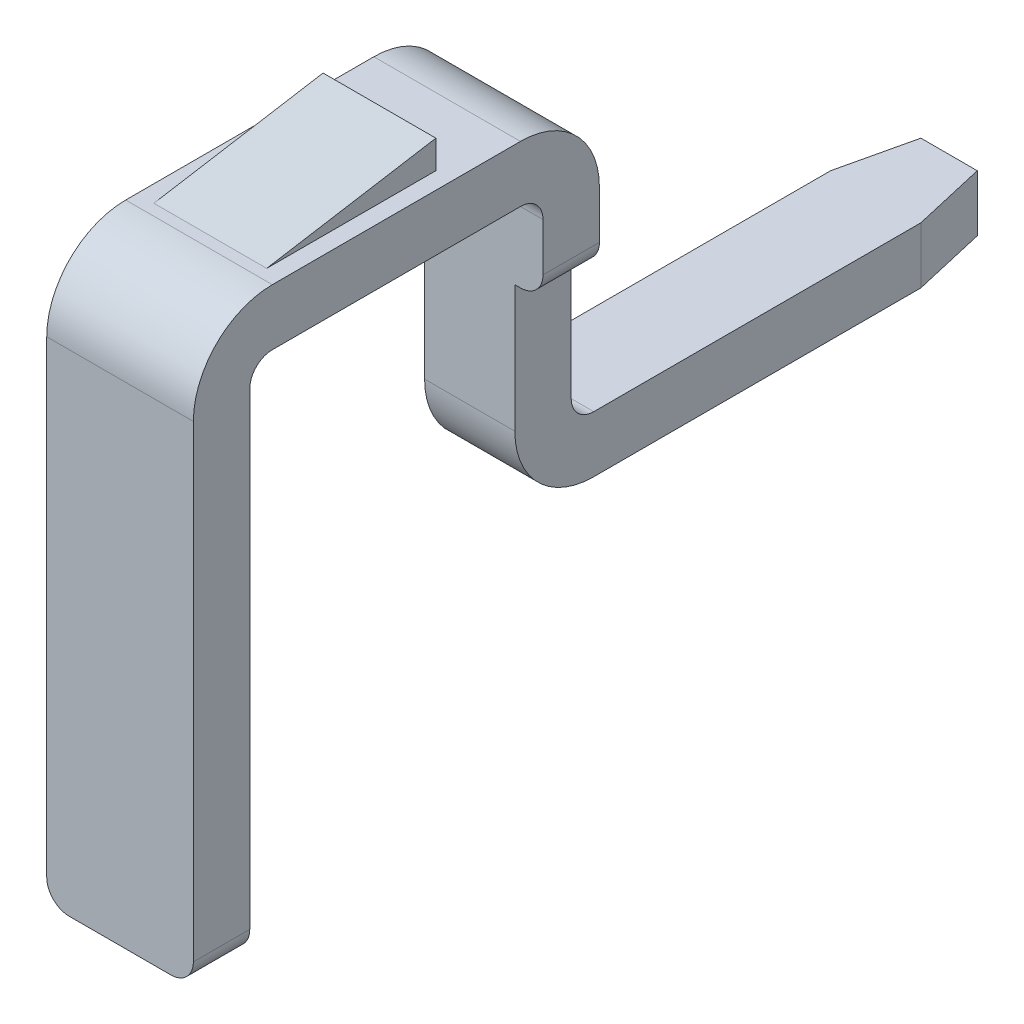
ISO-10303-21;
HEADER;
FILE_DESCRIPTION(('STEP AP214'),'2;1');
FILE_NAME('part.step','',(''),(''),'','','');
FILE_SCHEMA(('AUTOMOTIVE_DESIGN { 1 0 10303 214 1 1 1 1 }'));
ENDSEC;
DATA;
#1=APPLICATION_CONTEXT('core data for automotive mechanical design processes');
#2=APPLICATION_PROTOCOL_DEFINITION('international standard','automotive_design',2000,#1);
#3=PRODUCT_CONTEXT('',#1,'mechanical');
#4=PRODUCT('Part','Part','',(#3));
#5=PRODUCT_RELATED_PRODUCT_CATEGORY('part','',(#4));
#6=PRODUCT_DEFINITION_FORMATION('','',#4);
#7=PRODUCT_DEFINITION_CONTEXT('part definition',#1,'design');
#8=PRODUCT_DEFINITION('design','',#6,#7);
#9=PRODUCT_DEFINITION_SHAPE('','',#8);
#10=(LENGTH_UNIT() NAMED_UNIT(*) SI_UNIT(.MILLI.,.METRE.));
#11=(NAMED_UNIT(*) PLANE_ANGLE_UNIT() SI_UNIT($,.RADIAN.));
#12=(NAMED_UNIT(*) SI_UNIT($,.STERADIAN.) SOLID_ANGLE_UNIT());
#13=UNCERTAINTY_MEASURE_WITH_UNIT(LENGTH_MEASURE(1.E-05),#10,'distance_accuracy_value','');
#14=(GEOMETRIC_REPRESENTATION_CONTEXT(3) GLOBAL_UNCERTAINTY_ASSIGNED_CONTEXT((#13)) GLOBAL_UNIT_ASSIGNED_CONTEXT((#10,
#11,#12)) REPRESENTATION_CONTEXT('',''));
#15=CARTESIAN_POINT('',(0.,0.,0.));
#16=DIRECTION('',(0.,0.,1.));
#17=DIRECTION('',(1.,0.,0.));
#18=AXIS2_PLACEMENT_3D('',#15,#16,#17);
#19=CARTESIAN_POINT('',(-0.45,-1.95,3.8));
#20=DIRECTION('',(0.,0.,1.));
#21=DIRECTION('',(1.,0.,0.));
#22=AXIS2_PLACEMENT_3D('',#19,#20,#21);
#23=CYLINDRICAL_SURFACE('',#22,0.2);
#24=CARTESIAN_POINT('',(-0.45,-1.95,3.8));
#25=DIRECTION('',(0.,0.,1.));
#26=DIRECTION('',(1.,0.,0.));
#27=AXIS2_PLACEMENT_3D('',#24,#25,#26);
#28=CIRCLE('',#27,0.2);
#29=CARTESIAN_POINT('',(-0.65,-1.95,3.8));
#30=VERTEX_POINT('',#29);
#31=CARTESIAN_POINT('',(-0.45,-2.15,3.8));
#32=VERTEX_POINT('',#31);
#33=EDGE_CURVE('E358',#30,#32,#28,.T.);
#34=ORIENTED_EDGE('',*,*,#33,.F.);
#35=DIRECTION('',(0.,0.,1.));
#36=VECTOR('',#35,1.);
#37=CARTESIAN_POINT('',(-0.65,-1.95,3.8));
#38=LINE('',#37,#36);
#39=CARTESIAN_POINT('',(-0.65,-1.95,3.3));
#40=VERTEX_POINT('',#39);
#41=EDGE_CURVE('E321',#40,#30,#38,.T.);
#42=ORIENTED_EDGE('',*,*,#41,.F.);
#43=CARTESIAN_POINT('',(-0.45,-1.95,3.3));
#44=DIRECTION('',(0.,0.,-1.));
#45=DIRECTION('',(-1.,0.,0.));
#46=AXIS2_PLACEMENT_3D('',#43,#44,#45);
#47=CIRCLE('',#46,0.2);
#48=CARTESIAN_POINT('',(-0.45,-2.15,3.3));
#49=VERTEX_POINT('',#48);
#50=EDGE_CURVE('E541',#49,#40,#47,.T.);
#51=ORIENTED_EDGE('',*,*,#50,.F.);
#52=DIRECTION('',(0.,0.,-1.));
#53=VECTOR('',#52,1.);
#54=CARTESIAN_POINT('',(-0.45,-2.15,3.3));
#55=LINE('',#54,#53);
#56=EDGE_CURVE('E388',#32,#49,#55,.T.);
#57=ORIENTED_EDGE('',*,*,#56,.F.);
#58=EDGE_LOOP('',(#34,#42,#51,#57));
#59=FACE_BOUND('',#58,.T.);
#60=ADVANCED_FACE('F16',(#59),#23,.T.);
#61=CARTESIAN_POINT('',(0.45,-1.95,0.7));
#62=DIRECTION('',(0.,0.,1.));
#63=DIRECTION('',(1.,0.,0.));
#64=AXIS2_PLACEMENT_3D('',#61,#62,#63);
#65=CYLINDRICAL_SURFACE('',#64,0.2);
#66=CARTESIAN_POINT('',(0.45,-1.95,3.8));
#67=DIRECTION('',(0.,0.,1.));
#68=DIRECTION('',(1.,0.,0.));
#69=AXIS2_PLACEMENT_3D('',#66,#67,#68);
#70=CIRCLE('',#69,0.2);
#71=CARTESIAN_POINT('',(0.45,-2.15,3.8));
#72=VERTEX_POINT('',#71);
#73=CARTESIAN_POINT('',(0.65,-1.95,3.8));
#74=VERTEX_POINT('',#73);
#75=EDGE_CURVE('E357',#72,#74,#70,.T.);
#76=ORIENTED_EDGE('',*,*,#75,.F.);
#77=DIRECTION('',(0.,0.,1.));
#78=VECTOR('',#77,1.);
#79=CARTESIAN_POINT('',(0.45,-2.15,3.8));
#80=LINE('',#79,#78);
#81=CARTESIAN_POINT('',(0.45,-2.15,3.3));
#82=VERTEX_POINT('',#81);
#83=EDGE_CURVE('E384',#82,#72,#80,.T.);
#84=ORIENTED_EDGE('',*,*,#83,.F.);
#85=CARTESIAN_POINT('',(0.45,-1.95,3.3));
#86=DIRECTION('',(0.,0.,-1.));
#87=DIRECTION('',(-1.,0.,0.));
#88=AXIS2_PLACEMENT_3D('',#85,#86,#87);
#89=CIRCLE('',#88,0.2);
#90=CARTESIAN_POINT('',(0.65,-1.95,3.3));
#91=VERTEX_POINT('',#90);
#92=EDGE_CURVE('E407',#91,#82,#89,.T.);
#93=ORIENTED_EDGE('',*,*,#92,.F.);
#94=DIRECTION('',(0.,0.,-1.));
#95=VECTOR('',#94,1.);
#96=CARTESIAN_POINT('',(0.65,-1.95,3.3));
#97=LINE('',#96,#95);
#98=EDGE_CURVE('E406',#74,#91,#97,.T.);
#99=ORIENTED_EDGE('',*,*,#98,.F.);
#100=EDGE_LOOP('',(#76,#84,#93,#99));
#101=FACE_BOUND('',#100,.T.);
#102=ADVANCED_FACE('F621',(#101),#65,.T.);
#103=CARTESIAN_POINT('',(-0.5,3.15,1.5));
#104=DIRECTION('',(0.,-0.986393923832144,-0.164398987305357));
#105=DIRECTION('',(0.,0.164398987305357,-0.986393923832144));
#106=AXIS2_PLACEMENT_3D('',#103,#104,#105);
#107=PLANE('',#106);
#108=DIRECTION('',(0.,0.164398987305357,-0.986393923832144));
#109=VECTOR('',#108,1.);
#110=CARTESIAN_POINT('',(0.5,3.15,1.5));
#111=LINE('',#110,#109);
#112=CARTESIAN_POINT('',(0.5,2.9,3.));
#113=VERTEX_POINT('',#112);
#114=CARTESIAN_POINT('',(0.5,3.15,1.5));
#115=VERTEX_POINT('',#114);
#116=EDGE_CURVE('E416',#113,#115,#111,.T.);
#117=ORIENTED_EDGE('',*,*,#116,.T.);
#118=DIRECTION('',(-1.,0.,0.));
#119=VECTOR('',#118,1.);
#120=CARTESIAN_POINT('',(0.5,3.15,1.5));
#121=LINE('',#120,#119);
#122=CARTESIAN_POINT('',(-0.5,3.15,1.5));
#123=VERTEX_POINT('',#122);
#124=EDGE_CURVE('E27',#115,#123,#121,.T.);
#125=ORIENTED_EDGE('',*,*,#124,.T.);
#126=DIRECTION('',(0.,0.164398987305357,-0.986393923832144));
#127=VECTOR('',#126,1.);
#128=CARTESIAN_POINT('',(-0.5,3.15,1.5));
#129=LINE('',#128,#127);
#130=CARTESIAN_POINT('',(-0.5,2.9,3.));
#131=VERTEX_POINT('',#130);
#132=EDGE_CURVE('E11',#131,#123,#129,.T.);
#133=ORIENTED_EDGE('',*,*,#132,.F.);
#134=DIRECTION('',(1.,0.,0.));
#135=VECTOR('',#134,1.);
#136=CARTESIAN_POINT('',(-0.5,2.9,3.));
#137=LINE('',#136,#135);
#138=EDGE_CURVE('E428',#131,#113,#137,.T.);
#139=ORIENTED_EDGE('',*,*,#138,.T.);
#140=EDGE_LOOP('',(#117,#125,#133,#139));
#141=FACE_BOUND('',#140,.T.);
#142=ADVANCED_FACE('F627',(#141),#107,.F.);
#143=CARTESIAN_POINT('',(-0.5,3.15,1.5));
#144=DIRECTION('',(1.,0.,0.));
#145=DIRECTION('',(0.,0.,-1.));
#146=AXIS2_PLACEMENT_3D('',#143,#144,#145);
#147=PLANE('',#146);
#148=DIRECTION('',(0.,0.,1.));
#149=VECTOR('',#148,1.);
#150=CARTESIAN_POINT('',(-0.5,2.9,1.5));
#151=LINE('',#150,#149);
#152=CARTESIAN_POINT('',(-0.5,2.9,1.5));
#153=VERTEX_POINT('',#152);
#154=EDGE_CURVE('E424',#153,#131,#151,.T.);
#155=ORIENTED_EDGE('',*,*,#154,.T.);
#156=ORIENTED_EDGE('',*,*,#132,.T.);
#157=DIRECTION('',(0.,-1.,0.));
#158=VECTOR('',#157,1.);
#159=CARTESIAN_POINT('',(-0.5,3.15,1.5));
#160=LINE('',#159,#158);
#161=EDGE_CURVE('E387',#123,#153,#160,.T.);
#162=ORIENTED_EDGE('',*,*,#161,.T.);
#163=EDGE_LOOP('',(#155,#156,#162));
#164=FACE_BOUND('',#163,.T.);
#165=ADVANCED_FACE('F632',(#164),#147,.F.);
#166=CARTESIAN_POINT('',(0.5,3.15,1.5));
#167=DIRECTION('',(0.,0.,1.));
#168=DIRECTION('',(1.,0.,0.));
#169=AXIS2_PLACEMENT_3D('',#166,#167,#168);
#170=PLANE('',#169);
#171=DIRECTION('',(-1.,0.,0.));
#172=VECTOR('',#171,1.);
#173=CARTESIAN_POINT('',(0.5,2.9,1.5));
#174=LINE('',#173,#172);
#175=CARTESIAN_POINT('',(0.5,2.9,1.5));
#176=VERTEX_POINT('',#175);
#177=EDGE_CURVE('E520',#176,#153,#174,.T.);
#178=ORIENTED_EDGE('',*,*,#177,.T.);
#179=ORIENTED_EDGE('',*,*,#161,.F.);
#180=ORIENTED_EDGE('',*,*,#124,.F.);
#181=DIRECTION('',(0.,-1.,0.));
#182=VECTOR('',#181,1.);
#183=CARTESIAN_POINT('',(0.5,3.15,1.5));
#184=LINE('',#183,#182);
#185=EDGE_CURVE('E487',#115,#176,#184,.T.);
#186=ORIENTED_EDGE('',*,*,#185,.T.);
#187=EDGE_LOOP('',(#178,#179,#180,#186));
#188=FACE_BOUND('',#187,.T.);
#189=ADVANCED_FACE('F663',(#188),#170,.F.);
#190=CARTESIAN_POINT('',(0.4,-0.25,-2.9));
#191=DIRECTION('',(-0.97439119569462,0.,0.224859506698758));
#192=DIRECTION('',(0.,1.,0.));
#193=AXIS2_PLACEMENT_3D('',#190,#191,#192);
#194=PLANE('',#193);
#195=DIRECTION('',(0.224859506698758,0.,0.97439119569462));
#196=VECTOR('',#195,1.);
#197=CARTESIAN_POINT('',(0.4,-0.25,-2.9));
#198=LINE('',#197,#196);
#199=CARTESIAN_POINT('',(0.25,-0.25,-3.55));
#200=VERTEX_POINT('',#199);
#201=CARTESIAN_POINT('',(0.4,-0.25,-2.9));
#202=VERTEX_POINT('',#201);
#203=EDGE_CURVE('E256',#200,#202,#198,.T.);
#204=ORIENTED_EDGE('',*,*,#203,.F.);
#205=DIRECTION('',(0.,-1.,0.));
#206=VECTOR('',#205,1.);
#207=CARTESIAN_POINT('',(0.25,0.,-3.55));
#208=LINE('',#207,#206);
#209=CARTESIAN_POINT('',(0.25,0.25,-3.55));
#210=VERTEX_POINT('',#209);
#211=EDGE_CURVE('E249',#210,#200,#208,.T.);
#212=ORIENTED_EDGE('',*,*,#211,.F.);
#213=DIRECTION('',(-0.224859506698758,0.,-0.97439119569462));
#214=VECTOR('',#213,1.);
#215=CARTESIAN_POINT('',(0.4,0.25,-2.9));
#216=LINE('',#215,#214);
#217=CARTESIAN_POINT('',(0.4,0.25,-2.9));
#218=VERTEX_POINT('',#217);
#219=EDGE_CURVE('E253',#218,#210,#216,.T.);
#220=ORIENTED_EDGE('',*,*,#219,.F.);
#221=DIRECTION('',(0.,1.,0.));
#222=VECTOR('',#221,1.);
#223=CARTESIAN_POINT('',(0.4,-0.25,-2.9));
#224=LINE('',#223,#222);
#225=EDGE_CURVE('E20',#202,#218,#224,.T.);
#226=ORIENTED_EDGE('',*,*,#225,.F.);
#227=EDGE_LOOP('',(#204,#212,#220,#226));
#228=FACE_BOUND('',#227,.T.);
#229=ADVANCED_FACE('F251',(#228),#194,.F.);
#230=CARTESIAN_POINT('',(-0.4,0.25,-2.9));
#231=DIRECTION('',(0.97439119569462,0.,0.224859506698758));
#232=DIRECTION('',(0.,-1.,0.));
#233=AXIS2_PLACEMENT_3D('',#230,#231,#232);
#234=PLANE('',#233);
#235=DIRECTION('',(-0.224859506698758,0.,0.97439119569462));
#236=VECTOR('',#235,1.);
#237=CARTESIAN_POINT('',(-0.4,0.25,-2.9));
#238=LINE('',#237,#236);
#239=CARTESIAN_POINT('',(-0.25,0.25,-3.55));
#240=VERTEX_POINT('',#239);
#241=CARTESIAN_POINT('',(-0.4,0.25,-2.9));
#242=VERTEX_POINT('',#241);
#243=EDGE_CURVE('E278',#240,#242,#238,.T.);
#244=ORIENTED_EDGE('',*,*,#243,.F.);
#245=DIRECTION('',(0.,1.,0.));
#246=VECTOR('',#245,1.);
#247=CARTESIAN_POINT('',(-0.25,0.,-3.55));
#248=LINE('',#247,#246);
#249=CARTESIAN_POINT('',(-0.25,-0.25,-3.55));
#250=VERTEX_POINT('',#249);
#251=EDGE_CURVE('E263',#250,#240,#248,.T.);
#252=ORIENTED_EDGE('',*,*,#251,.F.);
#253=DIRECTION('',(0.224859506698758,0.,-0.97439119569462));
#254=VECTOR('',#253,1.);
#255=CARTESIAN_POINT('',(-0.4,-0.25,-2.9));
#256=LINE('',#255,#254);
#257=CARTESIAN_POINT('',(-0.4,-0.25,-2.9));
#258=VERTEX_POINT('',#257);
#259=EDGE_CURVE('E273',#258,#250,#256,.T.);
#260=ORIENTED_EDGE('',*,*,#259,.F.);
#261=DIRECTION('',(0.,-1.,0.));
#262=VECTOR('',#261,1.);
#263=CARTESIAN_POINT('',(-0.4,0.25,-2.9));
#264=LINE('',#263,#262);
#265=EDGE_CURVE('E441',#242,#258,#264,.T.);
#266=ORIENTED_EDGE('',*,*,#265,.F.);
#267=EDGE_LOOP('',(#244,#252,#260,#266));
#268=FACE_BOUND('',#267,.T.);
#269=ADVANCED_FACE('F658',(#268),#234,.F.);
#270=CARTESIAN_POINT('',(0.4,2.2,0.9));
#271=DIRECTION('',(-1.,0.,0.));
#272=DIRECTION('',(0.,0.,1.));
#273=AXIS2_PLACEMENT_3D('',#270,#271,#272);
#274=CYLINDRICAL_SURFACE('',#273,0.7);
#275=CARTESIAN_POINT('',(0.65,2.2,0.9));
#276=DIRECTION('',(1.,0.,0.));
#277=DIRECTION('',(0.,0.,1.));
#278=AXIS2_PLACEMENT_3D('',#275,#276,#277);
#279=CIRCLE('',#278,0.7);
#280=CARTESIAN_POINT('',(0.65,2.2,0.2));
#281=VERTEX_POINT('',#280);
#282=CARTESIAN_POINT('',(0.65,2.9,0.9));
#283=VERTEX_POINT('',#282);
#284=EDGE_CURVE('E317',#281,#283,#279,.T.);
#285=ORIENTED_EDGE('',*,*,#284,.F.);
#286=DIRECTION('',(1.,0.,0.));
#287=VECTOR('',#286,1.);
#288=CARTESIAN_POINT('',(0.4,2.2,0.2));
#289=LINE('',#288,#287);
#290=CARTESIAN_POINT('',(-0.65,2.2,0.2));
#291=VERTEX_POINT('',#290);
#292=EDGE_CURVE('E367',#291,#281,#289,.T.);
#293=ORIENTED_EDGE('',*,*,#292,.F.);
#294=CARTESIAN_POINT('',(-0.65,2.2,0.9));
#295=DIRECTION('',(-1.,0.,0.));
#296=DIRECTION('',(0.,0.,-1.));
#297=AXIS2_PLACEMENT_3D('',#294,#295,#296);
#298=CIRCLE('',#297,0.7);
#299=CARTESIAN_POINT('',(-0.65,2.9,0.9));
#300=VERTEX_POINT('',#299);
#301=EDGE_CURVE('E293',#300,#291,#298,.T.);
#302=ORIENTED_EDGE('',*,*,#301,.F.);
#303=DIRECTION('',(-1.,0.,0.));
#304=VECTOR('',#303,1.);
#305=CARTESIAN_POINT('',(0.4,2.9,0.9));
#306=LINE('',#305,#304);
#307=EDGE_CURVE('E492',#283,#300,#306,.T.);
#308=ORIENTED_EDGE('',*,*,#307,.F.);
#309=EDGE_LOOP('',(#285,#293,#302,#308));
#310=FACE_BOUND('',#309,.T.);
#311=ADVANCED_FACE('F469',(#310),#274,.T.);
#312=CARTESIAN_POINT('',(0.,2.2,3.1));
#313=DIRECTION('',(1.,0.,0.));
#314=DIRECTION('',(0.,0.,-1.));
#315=AXIS2_PLACEMENT_3D('',#312,#313,#314);
#316=CYLINDRICAL_SURFACE('',#315,0.7);
#317=CARTESIAN_POINT('',(0.65,2.2,3.1));
#318=DIRECTION('',(1.,0.,0.));
#319=DIRECTION('',(0.,0.,1.));
#320=AXIS2_PLACEMENT_3D('',#317,#318,#319);
#321=CIRCLE('',#320,0.7);
#322=CARTESIAN_POINT('',(0.65,2.9,3.1));
#323=VERTEX_POINT('',#322);
#324=CARTESIAN_POINT('',(0.65,2.2,3.8));
#325=VERTEX_POINT('',#324);
#326=EDGE_CURVE('E313',#323,#325,#321,.T.);
#327=ORIENTED_EDGE('',*,*,#326,.F.);
#328=DIRECTION('',(1.,0.,0.));
#329=VECTOR('',#328,1.);
#330=CARTESIAN_POINT('',(0.6,2.9,3.1));
#331=LINE('',#330,#329);
#332=CARTESIAN_POINT('',(-0.65,2.9,3.1));
#333=VERTEX_POINT('',#332);
#334=EDGE_CURVE('E524',#333,#323,#331,.T.);
#335=ORIENTED_EDGE('',*,*,#334,.F.);
#336=CARTESIAN_POINT('',(-0.65,2.2,3.1));
#337=DIRECTION('',(-1.,0.,0.));
#338=DIRECTION('',(0.,0.,-1.));
#339=AXIS2_PLACEMENT_3D('',#336,#337,#338);
#340=CIRCLE('',#339,0.7);
#341=CARTESIAN_POINT('',(-0.65,2.2,3.8));
#342=VERTEX_POINT('',#341);
#343=EDGE_CURVE('E318',#342,#333,#340,.T.);
#344=ORIENTED_EDGE('',*,*,#343,.F.);
#345=DIRECTION('',(-1.,0.,0.));
#346=VECTOR('',#345,1.);
#347=CARTESIAN_POINT('',(-0.6,2.2,3.8));
#348=LINE('',#347,#346);
#349=EDGE_CURVE('E438',#325,#342,#348,.T.);
#350=ORIENTED_EDGE('',*,*,#349,.F.);
#351=EDGE_LOOP('',(#327,#335,#344,#350));
#352=FACE_BOUND('',#351,.T.);
#353=ADVANCED_FACE('F657',(#352),#316,.T.);
#354=CARTESIAN_POINT('',(0.,0.45,0.));
#355=DIRECTION('',(-1.,0.,0.));
#356=DIRECTION('',(0.,0.,1.));
#357=AXIS2_PLACEMENT_3D('',#354,#355,#356);
#358=CYLINDRICAL_SURFACE('',#357,0.7);
#359=CARTESIAN_POINT('',(-0.4,0.45,0.));
#360=DIRECTION('',(-1.,0.,0.));
#361=DIRECTION('',(0.,0.,-1.));
#362=AXIS2_PLACEMENT_3D('',#359,#360,#361);
#363=CIRCLE('',#362,0.7);
#364=CARTESIAN_POINT('',(-0.4,-0.25,0.));
#365=VERTEX_POINT('',#364);
#366=CARTESIAN_POINT('',(-0.4,0.45,0.7));
#367=VERTEX_POINT('',#366);
#368=EDGE_CURVE('E307',#365,#367,#363,.T.);
#369=ORIENTED_EDGE('',*,*,#368,.F.);
#370=DIRECTION('',(-1.,0.,0.));
#371=VECTOR('',#370,1.);
#372=CARTESIAN_POINT('',(-0.4,-0.25,0.));
#373=LINE('',#372,#371);
#374=CARTESIAN_POINT('',(0.4,-0.25,0.));
#375=VERTEX_POINT('',#374);
#376=EDGE_CURVE('E322',#375,#365,#373,.T.);
#377=ORIENTED_EDGE('',*,*,#376,.F.);
#378=CARTESIAN_POINT('',(0.4,0.45,0.));
#379=DIRECTION('',(1.,0.,0.));
#380=DIRECTION('',(0.,0.,1.));
#381=AXIS2_PLACEMENT_3D('',#378,#379,#380);
#382=CIRCLE('',#381,0.7);
#383=CARTESIAN_POINT('',(0.4,0.45,0.7));
#384=VERTEX_POINT('',#383);
#385=EDGE_CURVE('E478',#384,#375,#382,.T.);
#386=ORIENTED_EDGE('',*,*,#385,.F.);
#387=DIRECTION('',(1.,0.,0.));
#388=VECTOR('',#387,1.);
#389=CARTESIAN_POINT('',(0.4,0.45,0.7));
#390=LINE('',#389,#388);
#391=EDGE_CURVE('E305',#367,#384,#390,.T.);
#392=ORIENTED_EDGE('',*,*,#391,.F.);
#393=EDGE_LOOP('',(#369,#377,#386,#392));
#394=FACE_BOUND('',#393,.T.);
#395=ADVANCED_FACE('F648',(#394),#358,.T.);
#396=CARTESIAN_POINT('',(0.,2.2,0.9));
#397=DIRECTION('',(1.,0.,0.));
#398=DIRECTION('',(0.,1.,0.));
#399=AXIS2_PLACEMENT_3D('',#396,#397,#398);
#400=CYLINDRICAL_SURFACE('',#399,0.2);
#401=CARTESIAN_POINT('',(0.65,2.2,0.9));
#402=DIRECTION('',(-1.,0.,0.));
#403=DIRECTION('',(0.,0.,1.));
#404=AXIS2_PLACEMENT_3D('',#401,#402,#403);
#405=CIRCLE('',#404,0.2);
#406=CARTESIAN_POINT('',(0.65,2.4,0.9));
#407=VERTEX_POINT('',#406);
#408=CARTESIAN_POINT('',(0.65,2.2,0.7));
#409=VERTEX_POINT('',#408);
#410=EDGE_CURVE('E546',#407,#409,#405,.T.);
#411=ORIENTED_EDGE('',*,*,#410,.F.);
#412=DIRECTION('',(1.,0.,0.));
#413=VECTOR('',#412,1.);
#414=CARTESIAN_POINT('',(0.6,2.4,0.9));
#415=LINE('',#414,#413);
#416=CARTESIAN_POINT('',(-0.65,2.4,0.9));
#417=VERTEX_POINT('',#416);
#418=EDGE_CURVE('E347',#417,#407,#415,.T.);
#419=ORIENTED_EDGE('',*,*,#418,.F.);
#420=CARTESIAN_POINT('',(-0.65,2.2,0.9));
#421=DIRECTION('',(1.,0.,0.));
#422=DIRECTION('',(0.,0.,-1.));
#423=AXIS2_PLACEMENT_3D('',#420,#421,#422);
#424=CIRCLE('',#423,0.2);
#425=CARTESIAN_POINT('',(-0.65,2.2,0.7));
#426=VERTEX_POINT('',#425);
#427=EDGE_CURVE('E378',#426,#417,#424,.T.);
#428=ORIENTED_EDGE('',*,*,#427,.F.);
#429=DIRECTION('',(-1.,0.,0.));
#430=VECTOR('',#429,1.);
#431=CARTESIAN_POINT('',(-0.6,2.2,0.7));
#432=LINE('',#431,#430);
#433=EDGE_CURVE('E337',#409,#426,#432,.T.);
#434=ORIENTED_EDGE('',*,*,#433,.F.);
#435=EDGE_LOOP('',(#411,#419,#428,#434));
#436=FACE_BOUND('',#435,.T.);
#437=ADVANCED_FACE('F565',(#436),#400,.F.);
#438=CARTESIAN_POINT('',(0.,2.2,3.1));
#439=DIRECTION('',(1.,0.,0.));
#440=DIRECTION('',(0.,1.,0.));
#441=AXIS2_PLACEMENT_3D('',#438,#439,#440);
#442=CYLINDRICAL_SURFACE('',#441,0.2);
#443=CARTESIAN_POINT('',(0.65,2.2,3.1));
#444=DIRECTION('',(-1.,0.,0.));
#445=DIRECTION('',(0.,0.,1.));
#446=AXIS2_PLACEMENT_3D('',#443,#444,#445);
#447=CIRCLE('',#446,0.2);
#448=CARTESIAN_POINT('',(0.65,2.2,3.3));
#449=VERTEX_POINT('',#448);
#450=CARTESIAN_POINT('',(0.65,2.4,3.1));
#451=VERTEX_POINT('',#450);
#452=EDGE_CURVE('E405',#449,#451,#447,.T.);
#453=ORIENTED_EDGE('',*,*,#452,.F.);
#454=DIRECTION('',(1.,0.,0.));
#455=VECTOR('',#454,1.);
#456=CARTESIAN_POINT('',(0.6,2.2,3.3));
#457=LINE('',#456,#455);
#458=CARTESIAN_POINT('',(-0.65,2.2,3.3));
#459=VERTEX_POINT('',#458);
#460=EDGE_CURVE('E411',#459,#449,#457,.T.);
#461=ORIENTED_EDGE('',*,*,#460,.F.);
#462=CARTESIAN_POINT('',(-0.65,2.2,3.1));
#463=DIRECTION('',(1.,0.,0.));
#464=DIRECTION('',(0.,0.,-1.));
#465=AXIS2_PLACEMENT_3D('',#462,#463,#464);
#466=CIRCLE('',#465,0.2);
#467=CARTESIAN_POINT('',(-0.65,2.4,3.1));
#468=VERTEX_POINT('',#467);
#469=EDGE_CURVE('E382',#468,#459,#466,.T.);
#470=ORIENTED_EDGE('',*,*,#469,.F.);
#471=DIRECTION('',(-1.,0.,0.));
#472=VECTOR('',#471,1.);
#473=CARTESIAN_POINT('',(-0.6,2.4,3.1));
#474=LINE('',#473,#472);
#475=EDGE_CURVE('E501',#451,#468,#474,.T.);
#476=ORIENTED_EDGE('',*,*,#475,.F.);
#477=EDGE_LOOP('',(#453,#461,#470,#476));
#478=FACE_BOUND('',#477,.T.);
#479=ADVANCED_FACE('F616',(#478),#442,.F.);
#480=CARTESIAN_POINT('',(0.45,1.775,0.2));
#481=DIRECTION('',(0.,0.,1.));
#482=DIRECTION('',(1.,0.,0.));
#483=AXIS2_PLACEMENT_3D('',#480,#481,#482);
#484=CYLINDRICAL_SURFACE('',#483,0.2);
#485=CARTESIAN_POINT('',(0.45,1.775,0.2));
#486=DIRECTION('',(0.,0.,-1.));
#487=DIRECTION('',(1.,0.,0.));
#488=AXIS2_PLACEMENT_3D('',#485,#486,#487);
#489=CIRCLE('',#488,0.2);
#490=CARTESIAN_POINT('',(0.65,1.775,0.2));
#491=VERTEX_POINT('',#490);
#492=CARTESIAN_POINT('',(0.449997009541553,1.575,0.2));
#493=VERTEX_POINT('',#492);
#494=EDGE_CURVE('E366',#491,#493,#489,.T.);
#495=ORIENTED_EDGE('',*,*,#494,.F.);
#496=DIRECTION('',(0.,0.,-1.));
#497=VECTOR('',#496,1.);
#498=CARTESIAN_POINT('',(0.65,1.775,0.7));
#499=LINE('',#498,#497);
#500=CARTESIAN_POINT('',(0.65,1.775,0.7));
#501=VERTEX_POINT('',#500);
#502=EDGE_CURVE('E361',#501,#491,#499,.T.);
#503=ORIENTED_EDGE('',*,*,#502,.F.);
#504=CARTESIAN_POINT('',(0.45,1.775,0.7));
#505=DIRECTION('',(0.,0.,1.));
#506=DIRECTION('',(1.,0.,0.));
#507=AXIS2_PLACEMENT_3D('',#504,#505,#506);
#508=CIRCLE('',#507,0.2);
#509=CARTESIAN_POINT('',(0.449997009541553,1.575,0.7));
#510=VERTEX_POINT('',#509);
#511=EDGE_CURVE('E338',#510,#501,#508,.T.);
#512=ORIENTED_EDGE('',*,*,#511,.F.);
#513=DIRECTION('',(0.,0.,-1.));
#514=VECTOR('',#513,1.);
#515=CARTESIAN_POINT('',(0.45,1.575,0.45));
#516=LINE('',#515,#514);
#517=EDGE_CURVE('E414',#510,#493,#516,.T.);
#518=ORIENTED_EDGE('',*,*,#517,.T.);
#519=EDGE_LOOP('',(#495,#503,#512,#518));
#520=FACE_BOUND('',#519,.T.);
#521=ADVANCED_FACE('F574',(#520),#484,.T.);
#522=CARTESIAN_POINT('',(-0.45,1.775,0.7));
#523=DIRECTION('',(0.,0.,-1.));
#524=DIRECTION('',(-1.,0.,0.));
#525=AXIS2_PLACEMENT_3D('',#522,#523,#524);
#526=CYLINDRICAL_SURFACE('',#525,0.2);
#527=CARTESIAN_POINT('',(-0.45,1.775,0.2));
#528=DIRECTION('',(0.,0.,-1.));
#529=DIRECTION('',(1.,0.,0.));
#530=AXIS2_PLACEMENT_3D('',#527,#528,#529);
#531=CIRCLE('',#530,0.2);
#532=CARTESIAN_POINT('',(-0.449997009541553,1.575,0.2));
#533=VERTEX_POINT('',#532);
#534=CARTESIAN_POINT('',(-0.65,1.775,0.2));
#535=VERTEX_POINT('',#534);
#536=EDGE_CURVE('E348',#533,#535,#531,.T.);
#537=ORIENTED_EDGE('',*,*,#536,.F.);
#538=DIRECTION('',(0.,0.,1.));
#539=VECTOR('',#538,1.);
#540=CARTESIAN_POINT('',(-0.45,1.575,0.45));
#541=LINE('',#540,#539);
#542=CARTESIAN_POINT('',(-0.449997009541553,1.575,0.7));
#543=VERTEX_POINT('',#542);
#544=EDGE_CURVE('E427',#533,#543,#541,.T.);
#545=ORIENTED_EDGE('',*,*,#544,.T.);
#546=CARTESIAN_POINT('',(-0.45,1.775,0.7));
#547=DIRECTION('',(0.,0.,1.));
#548=DIRECTION('',(1.,0.,0.));
#549=AXIS2_PLACEMENT_3D('',#546,#547,#548);
#550=CIRCLE('',#549,0.2);
#551=CARTESIAN_POINT('',(-0.65,1.775,0.7));
#552=VERTEX_POINT('',#551);
#553=EDGE_CURVE('E279',#552,#543,#550,.T.);
#554=ORIENTED_EDGE('',*,*,#553,.F.);
#555=DIRECTION('',(0.,0.,1.));
#556=VECTOR('',#555,1.);
#557=CARTESIAN_POINT('',(-0.65,1.775,0.7));
#558=LINE('',#557,#556);
#559=EDGE_CURVE('E383',#535,#552,#558,.T.);
#560=ORIENTED_EDGE('',*,*,#559,.F.);
#561=EDGE_LOOP('',(#537,#545,#554,#560));
#562=FACE_BOUND('',#561,.T.);
#563=ADVANCED_FACE('F604',(#562),#526,.T.);
#564=CARTESIAN_POINT('',(0.4,0.45,0.));
#565=DIRECTION('',(1.,0.,0.));
#566=DIRECTION('',(0.,0.,-1.));
#567=AXIS2_PLACEMENT_3D('',#564,#565,#566);
#568=CYLINDRICAL_SURFACE('',#567,0.2);
#569=CARTESIAN_POINT('',(0.4,0.45,0.));
#570=DIRECTION('',(-1.,0.,0.));
#571=DIRECTION('',(0.,0.,1.));
#572=AXIS2_PLACEMENT_3D('',#569,#570,#571);
#573=CIRCLE('',#572,0.2);
#574=CARTESIAN_POINT('',(0.4,0.25,0.));
#575=VERTEX_POINT('',#574);
#576=CARTESIAN_POINT('',(0.4,0.45,0.2));
#577=VERTEX_POINT('',#576);
#578=EDGE_CURVE('E328',#575,#577,#573,.T.);
#579=ORIENTED_EDGE('',*,*,#578,.F.);
#580=DIRECTION('',(1.,0.,0.));
#581=VECTOR('',#580,1.);
#582=CARTESIAN_POINT('',(0.4,0.25,0.));
#583=LINE('',#582,#581);
#584=CARTESIAN_POINT('',(-0.4,0.25,0.));
#585=VERTEX_POINT('',#584);
#586=EDGE_CURVE('E286',#585,#575,#583,.T.);
#587=ORIENTED_EDGE('',*,*,#586,.F.);
#588=CARTESIAN_POINT('',(-0.4,0.45,0.));
#589=DIRECTION('',(1.,0.,0.));
#590=DIRECTION('',(0.,0.,-1.));
#591=AXIS2_PLACEMENT_3D('',#588,#589,#590);
#592=CIRCLE('',#591,0.2);
#593=CARTESIAN_POINT('',(-0.4,0.45,0.2));
#594=VERTEX_POINT('',#593);
#595=EDGE_CURVE('E301',#594,#585,#592,.T.);
#596=ORIENTED_EDGE('',*,*,#595,.F.);
#597=DIRECTION('',(-1.,0.,0.));
#598=VECTOR('',#597,1.);
#599=CARTESIAN_POINT('',(-0.4,0.45,0.2));
#600=LINE('',#599,#598);
#601=EDGE_CURVE('E431',#577,#594,#600,.T.);
#602=ORIENTED_EDGE('',*,*,#601,.F.);
#603=EDGE_LOOP('',(#579,#587,#596,#602));
#604=FACE_BOUND('',#603,.T.);
#605=ADVANCED_FACE('F606',(#604),#568,.F.);
#606=CARTESIAN_POINT('',(0.,-2.15,3.8));
#607=DIRECTION('',(0.,-1.,0.));
#608=DIRECTION('',(-1.,0.,0.));
#609=AXIS2_PLACEMENT_3D('',#606,#607,#608);
#610=PLANE('',#609);
#611=DIRECTION('',(-1.,0.,0.));
#612=VECTOR('',#611,1.);
#613=CARTESIAN_POINT('',(0.,-2.15,3.8));
#614=LINE('',#613,#612);
#615=EDGE_CURVE('E353',#72,#32,#614,.T.);
#616=ORIENTED_EDGE('',*,*,#615,.T.);
#617=ORIENTED_EDGE('',*,*,#56,.T.);
#618=DIRECTION('',(-1.,0.,0.));
#619=VECTOR('',#618,1.);
#620=CARTESIAN_POINT('',(0.,-2.15,3.3));
#621=LINE('',#620,#619);
#622=EDGE_CURVE('E537',#82,#49,#621,.T.);
#623=ORIENTED_EDGE('',*,*,#622,.F.);
#624=ORIENTED_EDGE('',*,*,#83,.T.);
#625=EDGE_LOOP('',(#616,#617,#623,#624));
#626=FACE_BOUND('',#625,.T.);
#627=ADVANCED_FACE('F613',(#626),#610,.T.);
#628=CARTESIAN_POINT('',(0.,-1.9,3.3));
#629=DIRECTION('',(0.,0.,-1.));
#630=DIRECTION('',(0.,-1.,0.));
#631=AXIS2_PLACEMENT_3D('',#628,#629,#630);
#632=PLANE('',#631);
#633=ORIENTED_EDGE('',*,*,#622,.T.);
#634=ORIENTED_EDGE('',*,*,#50,.T.);
#635=DIRECTION('',(0.,1.,0.));
#636=VECTOR('',#635,1.);
#637=CARTESIAN_POINT('',(-0.65,0.25,3.3));
#638=LINE('',#637,#636);
#639=EDGE_CURVE('E316',#40,#459,#638,.T.);
#640=ORIENTED_EDGE('',*,*,#639,.T.);
#641=ORIENTED_EDGE('',*,*,#460,.T.);
#642=DIRECTION('',(0.,1.,0.));
#643=VECTOR('',#642,1.);
#644=CARTESIAN_POINT('',(0.65,-0.25,3.3));
#645=LINE('',#644,#643);
#646=EDGE_CURVE('E401',#91,#449,#645,.T.);
#647=ORIENTED_EDGE('',*,*,#646,.F.);
#648=ORIENTED_EDGE('',*,*,#92,.T.);
#649=EDGE_LOOP('',(#633,#634,#640,#641,#647,#648));
#650=FACE_BOUND('',#649,.T.);
#651=ADVANCED_FACE('F18',(#650),#632,.T.);
#652=CARTESIAN_POINT('',(-0.65,0.25,0.7));
#653=DIRECTION('',(1.,0.,0.));
#654=DIRECTION('',(0.,1.,0.));
#655=AXIS2_PLACEMENT_3D('',#652,#653,#654);
#656=PLANE('',#655);
#657=ORIENTED_EDGE('',*,*,#639,.F.);
#658=ORIENTED_EDGE('',*,*,#41,.T.);
#659=DIRECTION('',(0.,-1.,0.));
#660=VECTOR('',#659,1.);
#661=CARTESIAN_POINT('',(-0.65,0.25,3.8));
#662=LINE('',#661,#660);
#663=EDGE_CURVE('E505',#342,#30,#662,.T.);
#664=ORIENTED_EDGE('',*,*,#663,.F.);
#665=ORIENTED_EDGE('',*,*,#343,.T.);
#666=DIRECTION('',(0.,0.,-1.));
#667=VECTOR('',#666,1.);
#668=CARTESIAN_POINT('',(-0.65,2.9,0.7));
#669=LINE('',#668,#667);
#670=EDGE_CURVE('E463',#333,#300,#669,.T.);
#671=ORIENTED_EDGE('',*,*,#670,.T.);
#672=ORIENTED_EDGE('',*,*,#301,.T.);
#673=DIRECTION('',(0.,-1.,0.));
#674=VECTOR('',#673,1.);
#675=CARTESIAN_POINT('',(-0.65,0.25,0.2));
#676=LINE('',#675,#674);
#677=EDGE_CURVE('E262',#291,#535,#676,.T.);
#678=ORIENTED_EDGE('',*,*,#677,.T.);
#679=ORIENTED_EDGE('',*,*,#559,.T.);
#680=DIRECTION('',(0.,-1.,0.));
#681=VECTOR('',#680,1.);
#682=CARTESIAN_POINT('',(-0.65,0.25,0.7));
#683=LINE('',#682,#681);
#684=EDGE_CURVE('E289',#426,#552,#683,.T.);
#685=ORIENTED_EDGE('',*,*,#684,.F.);
#686=ORIENTED_EDGE('',*,*,#427,.T.);
#687=DIRECTION('',(0.,0.,-1.));
#688=VECTOR('',#687,1.);
#689=CARTESIAN_POINT('',(-0.65,2.4,0.7));
#690=LINE('',#689,#688);
#691=EDGE_CURVE('E343',#468,#417,#690,.T.);
#692=ORIENTED_EDGE('',*,*,#691,.F.);
#693=ORIENTED_EDGE('',*,*,#469,.T.);
#694=EDGE_LOOP('',(#657,#658,#664,#665,#671,#672,#678,#679,#685,#686,#692,#693));
#695=FACE_BOUND('',#694,.T.);
#696=ADVANCED_FACE('F457',(#695),#656,.F.);
#697=CARTESIAN_POINT('',(0.65,-0.25,0.7));
#698=DIRECTION('',(-1.,0.,0.));
#699=DIRECTION('',(0.,0.,1.));
#700=AXIS2_PLACEMENT_3D('',#697,#698,#699);
#701=PLANE('',#700);
#702=DIRECTION('',(0.,1.,0.));
#703=VECTOR('',#702,1.);
#704=CARTESIAN_POINT('',(0.65,-0.25,3.8));
#705=LINE('',#704,#703);
#706=EDGE_CURVE('E434',#74,#325,#705,.T.);
#707=ORIENTED_EDGE('',*,*,#706,.F.);
#708=ORIENTED_EDGE('',*,*,#98,.T.);
#709=ORIENTED_EDGE('',*,*,#646,.T.);
#710=ORIENTED_EDGE('',*,*,#452,.T.);
#711=DIRECTION('',(0.,0.,-1.));
#712=VECTOR('',#711,1.);
#713=CARTESIAN_POINT('',(0.65,2.4,0.7));
#714=LINE('',#713,#712);
#715=EDGE_CURVE('E352',#451,#407,#714,.T.);
#716=ORIENTED_EDGE('',*,*,#715,.T.);
#717=ORIENTED_EDGE('',*,*,#410,.T.);
#718=DIRECTION('',(0.,1.,0.));
#719=VECTOR('',#718,1.);
#720=CARTESIAN_POINT('',(0.65,-0.25,0.7));
#721=LINE('',#720,#719);
#722=EDGE_CURVE('E333',#501,#409,#721,.T.);
#723=ORIENTED_EDGE('',*,*,#722,.F.);
#724=ORIENTED_EDGE('',*,*,#502,.T.);
#725=DIRECTION('',(0.,-1.,0.));
#726=VECTOR('',#725,1.);
#727=CARTESIAN_POINT('',(0.65,-0.25,0.2));
#728=LINE('',#727,#726);
#729=EDGE_CURVE('E362',#281,#491,#728,.T.);
#730=ORIENTED_EDGE('',*,*,#729,.F.);
#731=ORIENTED_EDGE('',*,*,#284,.T.);
#732=DIRECTION('',(0.,0.,-1.));
#733=VECTOR('',#732,1.);
#734=CARTESIAN_POINT('',(0.65,2.9,0.7));
#735=LINE('',#734,#733);
#736=EDGE_CURVE('E488',#323,#283,#735,.T.);
#737=ORIENTED_EDGE('',*,*,#736,.F.);
#738=ORIENTED_EDGE('',*,*,#326,.T.);
#739=EDGE_LOOP('',(#707,#708,#709,#710,#716,#717,#723,#724,#730,#731,#737,#738));
#740=FACE_BOUND('',#739,.T.);
#741=ADVANCED_FACE('F555',(#740),#701,.F.);
#742=CARTESIAN_POINT('',(0.,0.,3.8));
#743=DIRECTION('',(0.,0.,1.));
#744=DIRECTION('',(1.,0.,0.));
#745=AXIS2_PLACEMENT_3D('',#742,#743,#744);
#746=PLANE('',#745);
#747=ORIENTED_EDGE('',*,*,#663,.T.);
#748=ORIENTED_EDGE('',*,*,#33,.T.);
#749=ORIENTED_EDGE('',*,*,#615,.F.);
#750=ORIENTED_EDGE('',*,*,#75,.T.);
#751=ORIENTED_EDGE('',*,*,#706,.T.);
#752=ORIENTED_EDGE('',*,*,#349,.T.);
#753=EDGE_LOOP('',(#747,#748,#749,#750,#751,#752));
#754=FACE_BOUND('',#753,.T.);
#755=ADVANCED_FACE('F635',(#754),#746,.T.);
#756=CARTESIAN_POINT('',(0.,2.4,3.8));
#757=DIRECTION('',(0.,-1.,0.));
#758=DIRECTION('',(-1.,0.,0.));
#759=AXIS2_PLACEMENT_3D('',#756,#757,#758);
#760=PLANE('',#759);
#761=ORIENTED_EDGE('',*,*,#691,.T.);
#762=ORIENTED_EDGE('',*,*,#418,.T.);
#763=ORIENTED_EDGE('',*,*,#715,.F.);
#764=ORIENTED_EDGE('',*,*,#475,.T.);
#765=EDGE_LOOP('',(#761,#762,#763,#764));
#766=FACE_BOUND('',#765,.T.);
#767=ADVANCED_FACE('F562',(#766),#760,.T.);
#768=CARTESIAN_POINT('',(0.4,2.9,0.2));
#769=DIRECTION('',(0.,0.,1.));
#770=DIRECTION('',(1.,0.,0.));
#771=AXIS2_PLACEMENT_3D('',#768,#769,#770);
#772=PLANE('',#771);
#773=ORIENTED_EDGE('',*,*,#677,.F.);
#774=ORIENTED_EDGE('',*,*,#292,.T.);
#775=ORIENTED_EDGE('',*,*,#729,.T.);
#776=ORIENTED_EDGE('',*,*,#494,.T.);
#777=DIRECTION('',(-1.,0.,0.));
#778=VECTOR('',#777,1.);
#779=CARTESIAN_POINT('',(0.4,1.575,0.2));
#780=LINE('',#779,#778);
#781=CARTESIAN_POINT('',(0.4,1.575,0.2));
#782=VERTEX_POINT('',#781);
#783=EDGE_CURVE('E372',#493,#782,#780,.T.);
#784=ORIENTED_EDGE('',*,*,#783,.T.);
#785=DIRECTION('',(0.,-1.,0.));
#786=VECTOR('',#785,1.);
#787=CARTESIAN_POINT('',(0.4,2.9,0.2));
#788=LINE('',#787,#786);
#789=EDGE_CURVE('E332',#782,#577,#788,.T.);
#790=ORIENTED_EDGE('',*,*,#789,.T.);
#791=ORIENTED_EDGE('',*,*,#601,.T.);
#792=DIRECTION('',(0.,-1.,0.));
#793=VECTOR('',#792,1.);
#794=CARTESIAN_POINT('',(-0.4,2.9,0.2));
#795=LINE('',#794,#793);
#796=CARTESIAN_POINT('',(-0.4,1.575,0.2));
#797=VERTEX_POINT('',#796);
#798=EDGE_CURVE('E306',#797,#594,#795,.T.);
#799=ORIENTED_EDGE('',*,*,#798,.F.);
#800=DIRECTION('',(1.,0.,0.));
#801=VECTOR('',#800,1.);
#802=CARTESIAN_POINT('',(-0.6,1.575,0.2));
#803=LINE('',#802,#801);
#804=EDGE_CURVE('E300',#533,#797,#803,.T.);
#805=ORIENTED_EDGE('',*,*,#804,.F.);
#806=ORIENTED_EDGE('',*,*,#536,.T.);
#807=EDGE_LOOP('',(#773,#774,#775,#776,#784,#790,#791,#799,#805,#806));
#808=FACE_BOUND('',#807,.T.);
#809=ADVANCED_FACE('F449',(#808),#772,.F.);
#810=CARTESIAN_POINT('',(0.,0.,-3.55));
#811=DIRECTION('',(0.,0.,1.));
#812=DIRECTION('',(1.,0.,0.));
#813=AXIS2_PLACEMENT_3D('',#810,#811,#812);
#814=PLANE('',#813);
#815=DIRECTION('',(1.,0.,0.));
#816=VECTOR('',#815,1.);
#817=CARTESIAN_POINT('',(-0.4,-0.25,-3.55));
#818=LINE('',#817,#816);
#819=EDGE_CURVE('E342',#250,#200,#818,.T.);
#820=ORIENTED_EDGE('',*,*,#819,.F.);
#821=ORIENTED_EDGE('',*,*,#251,.T.);
#822=DIRECTION('',(-1.,0.,0.));
#823=VECTOR('',#822,1.);
#824=CARTESIAN_POINT('',(0.4,0.25,-3.55));
#825=LINE('',#824,#823);
#826=EDGE_CURVE('E268',#210,#240,#825,.T.);
#827=ORIENTED_EDGE('',*,*,#826,.F.);
#828=ORIENTED_EDGE('',*,*,#211,.T.);
#829=EDGE_LOOP('',(#820,#821,#827,#828));
#830=FACE_BOUND('',#829,.T.);
#831=ADVANCED_FACE('F275',(#830),#814,.F.);
#832=CARTESIAN_POINT('',(0.4,-0.25,0.7));
#833=DIRECTION('',(-1.,0.,0.));
#834=DIRECTION('',(0.,0.,1.));
#835=AXIS2_PLACEMENT_3D('',#832,#833,#834);
#836=PLANE('',#835);
#837=DIRECTION('',(0.,0.,-1.));
#838=VECTOR('',#837,1.);
#839=CARTESIAN_POINT('',(0.4,-0.25,0.7));
#840=LINE('',#839,#838);
#841=EDGE_CURVE('E325',#375,#202,#840,.T.);
#842=ORIENTED_EDGE('',*,*,#841,.T.);
#843=ORIENTED_EDGE('',*,*,#225,.T.);
#844=DIRECTION('',(0.,0.,-1.));
#845=VECTOR('',#844,1.);
#846=CARTESIAN_POINT('',(0.4,0.25,0.7));
#847=LINE('',#846,#845);
#848=EDGE_CURVE('E271',#575,#218,#847,.T.);
#849=ORIENTED_EDGE('',*,*,#848,.F.);
#850=ORIENTED_EDGE('',*,*,#578,.T.);
#851=ORIENTED_EDGE('',*,*,#789,.F.);
#852=DIRECTION('',(0.,0.,1.));
#853=VECTOR('',#852,1.);
#854=CARTESIAN_POINT('',(0.4,1.575,0.2));
#855=LINE('',#854,#853);
#856=CARTESIAN_POINT('',(0.4,1.575,0.7));
#857=VERTEX_POINT('',#856);
#858=EDGE_CURVE('E368',#782,#857,#855,.T.);
#859=ORIENTED_EDGE('',*,*,#858,.T.);
#860=DIRECTION('',(0.,1.,0.));
#861=VECTOR('',#860,1.);
#862=CARTESIAN_POINT('',(0.4,-0.25,0.7));
#863=LINE('',#862,#861);
#864=EDGE_CURVE('E377',#384,#857,#863,.T.);
#865=ORIENTED_EDGE('',*,*,#864,.F.);
#866=ORIENTED_EDGE('',*,*,#385,.T.);
#867=EDGE_LOOP('',(#842,#843,#849,#850,#851,#859,#865,#866));
#868=FACE_BOUND('',#867,.T.);
#869=ADVANCED_FACE('F584',(#868),#836,.F.);
#870=CARTESIAN_POINT('',(-0.4,-0.25,0.7));
#871=DIRECTION('',(0.,1.,0.));
#872=DIRECTION('',(1.,0.,0.));
#873=AXIS2_PLACEMENT_3D('',#870,#871,#872);
#874=PLANE('',#873);
#875=DIRECTION('',(0.,0.,-1.));
#876=VECTOR('',#875,1.);
#877=CARTESIAN_POINT('',(-0.4,-0.25,0.7));
#878=LINE('',#877,#876);
#879=EDGE_CURVE('E312',#365,#258,#878,.T.);
#880=ORIENTED_EDGE('',*,*,#879,.T.);
#881=ORIENTED_EDGE('',*,*,#259,.T.);
#882=ORIENTED_EDGE('',*,*,#819,.T.);
#883=ORIENTED_EDGE('',*,*,#203,.T.);
#884=ORIENTED_EDGE('',*,*,#841,.F.);
#885=ORIENTED_EDGE('',*,*,#376,.T.);
#886=EDGE_LOOP('',(#880,#881,#882,#883,#884,#885));
#887=FACE_BOUND('',#886,.T.);
#888=ADVANCED_FACE('F642',(#887),#874,.F.);
#889=CARTESIAN_POINT('',(0.4,0.25,0.7));
#890=DIRECTION('',(0.,-1.,0.));
#891=DIRECTION('',(0.,0.,-1.));
#892=AXIS2_PLACEMENT_3D('',#889,#890,#891);
#893=PLANE('',#892);
#894=ORIENTED_EDGE('',*,*,#826,.T.);
#895=ORIENTED_EDGE('',*,*,#243,.T.);
#896=DIRECTION('',(0.,0.,-1.));
#897=VECTOR('',#896,1.);
#898=CARTESIAN_POINT('',(-0.4,0.25,0.7));
#899=LINE('',#898,#897);
#900=EDGE_CURVE('E392',#585,#242,#899,.T.);
#901=ORIENTED_EDGE('',*,*,#900,.F.);
#902=ORIENTED_EDGE('',*,*,#586,.T.);
#903=ORIENTED_EDGE('',*,*,#848,.T.);
#904=ORIENTED_EDGE('',*,*,#219,.T.);
#905=EDGE_LOOP('',(#894,#895,#901,#902,#903,#904));
#906=FACE_BOUND('',#905,.T.);
#907=ADVANCED_FACE('F267',(#906),#893,.F.);
#908=CARTESIAN_POINT('',(0.,0.,0.7));
#909=DIRECTION('',(0.,0.,1.));
#910=DIRECTION('',(1.,0.,0.));
#911=AXIS2_PLACEMENT_3D('',#908,#909,#910);
#912=PLANE('',#911);
#913=DIRECTION('',(0.,-1.,0.));
#914=VECTOR('',#913,1.);
#915=CARTESIAN_POINT('',(-0.4,0.25,0.7));
#916=LINE('',#915,#914);
#917=CARTESIAN_POINT('',(-0.4,1.575,0.7));
#918=VERTEX_POINT('',#917);
#919=EDGE_CURVE('E311',#918,#367,#916,.T.);
#920=ORIENTED_EDGE('',*,*,#919,.T.);
#921=ORIENTED_EDGE('',*,*,#391,.T.);
#922=ORIENTED_EDGE('',*,*,#864,.T.);
#923=DIRECTION('',(-1.,0.,0.));
#924=VECTOR('',#923,1.);
#925=CARTESIAN_POINT('',(0.,1.575,0.7));
#926=LINE('',#925,#924);
#927=EDGE_CURVE('E373',#510,#857,#926,.T.);
#928=ORIENTED_EDGE('',*,*,#927,.F.);
#929=ORIENTED_EDGE('',*,*,#511,.T.);
#930=ORIENTED_EDGE('',*,*,#722,.T.);
#931=ORIENTED_EDGE('',*,*,#433,.T.);
#932=ORIENTED_EDGE('',*,*,#684,.T.);
#933=ORIENTED_EDGE('',*,*,#553,.T.);
#934=DIRECTION('',(1.,0.,0.));
#935=VECTOR('',#934,1.);
#936=CARTESIAN_POINT('',(-0.6,1.575,0.7));
#937=LINE('',#936,#935);
#938=EDGE_CURVE('E299',#543,#918,#937,.T.);
#939=ORIENTED_EDGE('',*,*,#938,.T.);
#940=EDGE_LOOP('',(#920,#921,#922,#928,#929,#930,#931,#932,#933,#939));
#941=FACE_BOUND('',#940,.T.);
#942=ADVANCED_FACE('F570',(#941),#912,.T.);
#943=CARTESIAN_POINT('',(-0.4,0.25,0.7));
#944=DIRECTION('',(1.,0.,0.));
#945=DIRECTION('',(0.,1.,0.));
#946=AXIS2_PLACEMENT_3D('',#943,#944,#945);
#947=PLANE('',#946);
#948=ORIENTED_EDGE('',*,*,#900,.T.);
#949=ORIENTED_EDGE('',*,*,#265,.T.);
#950=ORIENTED_EDGE('',*,*,#879,.F.);
#951=ORIENTED_EDGE('',*,*,#368,.T.);
#952=ORIENTED_EDGE('',*,*,#919,.F.);
#953=DIRECTION('',(0.,0.,1.));
#954=VECTOR('',#953,1.);
#955=CARTESIAN_POINT('',(-0.4,1.575,0.7));
#956=LINE('',#955,#954);
#957=EDGE_CURVE('E295',#797,#918,#956,.T.);
#958=ORIENTED_EDGE('',*,*,#957,.F.);
#959=ORIENTED_EDGE('',*,*,#798,.T.);
#960=ORIENTED_EDGE('',*,*,#595,.T.);
#961=EDGE_LOOP('',(#948,#949,#950,#951,#952,#958,#959,#960));
#962=FACE_BOUND('',#961,.T.);
#963=ADVANCED_FACE('F654',(#962),#947,.F.);
#964=CARTESIAN_POINT('',(0.6,1.575,0.2));
#965=DIRECTION('',(0.,1.,0.));
#966=DIRECTION('',(1.,0.,0.));
#967=AXIS2_PLACEMENT_3D('',#964,#965,#966);
#968=PLANE('',#967);
#969=ORIENTED_EDGE('',*,*,#517,.F.);
#970=ORIENTED_EDGE('',*,*,#927,.T.);
#971=ORIENTED_EDGE('',*,*,#858,.F.);
#972=ORIENTED_EDGE('',*,*,#783,.F.);
#973=EDGE_LOOP('',(#969,#970,#971,#972));
#974=FACE_BOUND('',#973,.T.);
#975=ADVANCED_FACE('F580',(#974),#968,.F.);
#976=CARTESIAN_POINT('',(-0.6,1.575,0.7));
#977=DIRECTION('',(0.,1.,0.));
#978=DIRECTION('',(1.,0.,0.));
#979=AXIS2_PLACEMENT_3D('',#976,#977,#978);
#980=PLANE('',#979);
#981=ORIENTED_EDGE('',*,*,#544,.F.);
#982=ORIENTED_EDGE('',*,*,#804,.T.);
#983=ORIENTED_EDGE('',*,*,#957,.T.);
#984=ORIENTED_EDGE('',*,*,#938,.F.);
#985=EDGE_LOOP('',(#981,#982,#983,#984));
#986=FACE_BOUND('',#985,.T.);
#987=ADVANCED_FACE('F600',(#986),#980,.F.);
#988=CARTESIAN_POINT('',(0.4,2.9,0.7));
#989=DIRECTION('',(0.,-1.,0.));
#990=DIRECTION('',(0.,0.,-1.));
#991=AXIS2_PLACEMENT_3D('',#988,#989,#990);
#992=PLANE('',#991);
#993=ORIENTED_EDGE('',*,*,#177,.F.);
#994=DIRECTION('',(0.,0.,-1.));
#995=VECTOR('',#994,1.);
#996=CARTESIAN_POINT('',(0.5,2.9,3.));
#997=LINE('',#996,#995);
#998=EDGE_CURVE('E420',#113,#176,#997,.T.);
#999=ORIENTED_EDGE('',*,*,#998,.F.);
#1000=ORIENTED_EDGE('',*,*,#138,.F.);
#1001=ORIENTED_EDGE('',*,*,#154,.F.);
#1002=EDGE_LOOP('',(#993,#999,#1000,#1001));
#1003=FACE_BOUND('',#1002,.T.);
#1004=ORIENTED_EDGE('',*,*,#736,.T.);
#1005=ORIENTED_EDGE('',*,*,#307,.T.);
#1006=ORIENTED_EDGE('',*,*,#670,.F.);
#1007=ORIENTED_EDGE('',*,*,#334,.T.);
#1008=EDGE_LOOP('',(#1004,#1005,#1006,#1007));
#1009=FACE_BOUND('',#1008,.T.);
#1010=ADVANCED_FACE('F641',(#1003,#1009),#992,.F.);
#1011=CARTESIAN_POINT('',(0.5,3.15,3.));
#1012=DIRECTION('',(-1.,0.,0.));
#1013=DIRECTION('',(0.,1.,0.));
#1014=AXIS2_PLACEMENT_3D('',#1011,#1012,#1013);
#1015=PLANE('',#1014);
#1016=ORIENTED_EDGE('',*,*,#116,.F.);
#1017=ORIENTED_EDGE('',*,*,#998,.T.);
#1018=ORIENTED_EDGE('',*,*,#185,.F.);
#1019=EDGE_LOOP('',(#1016,#1017,#1018));
#1020=FACE_BOUND('',#1019,.T.);
#1021=ADVANCED_FACE('F755',(#1020),#1015,.F.);
#1022=CLOSED_SHELL('',(#60,#102,#142,#165,#189,#229,#269,#311,#353,#395,#437,#479,#521,#563,
#605,#627,#651,#696,#741,#755,#767,#809,#831,#869,#888,#907,#942,#963,#975,#987,#1010,#1021));
#1023=MANIFOLD_SOLID_BREP('B1',#1022);
#1024=ADVANCED_BREP_SHAPE_REPRESENTATION('',(#18,#1023),#14);
#1025=SHAPE_DEFINITION_REPRESENTATION(#9,#1024);
ENDSEC;
END-ISO-10303-21;
